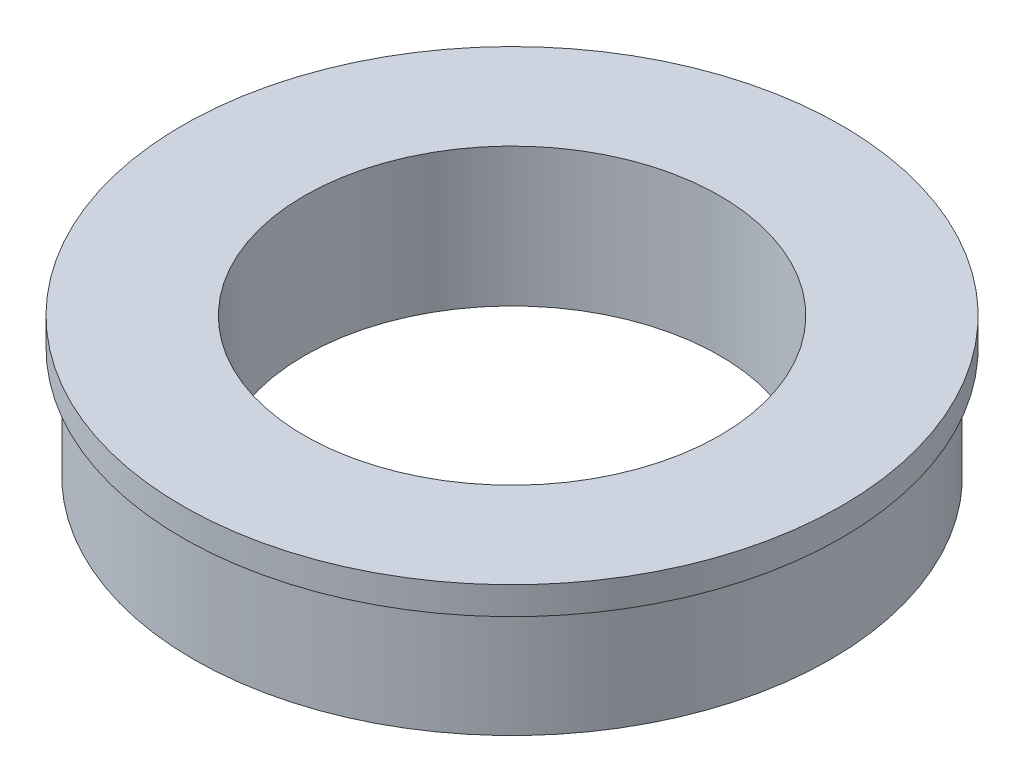
ISO-10303-21;
HEADER;
FILE_DESCRIPTION(('STEP AP214'),'2;1');
FILE_NAME('part.step','',(''),(''),'','','');
FILE_SCHEMA(('AUTOMOTIVE_DESIGN { 1 0 10303 214 1 1 1 1 }'));
ENDSEC;
DATA;
#1=APPLICATION_CONTEXT('core data for automotive mechanical design processes');
#2=APPLICATION_PROTOCOL_DEFINITION('international standard','automotive_design',2000,#1);
#3=PRODUCT_CONTEXT('',#1,'mechanical');
#4=PRODUCT('Part','Part','',(#3));
#5=PRODUCT_RELATED_PRODUCT_CATEGORY('part','',(#4));
#6=PRODUCT_DEFINITION_FORMATION('','',#4);
#7=PRODUCT_DEFINITION_CONTEXT('part definition',#1,'design');
#8=PRODUCT_DEFINITION('design','',#6,#7);
#9=PRODUCT_DEFINITION_SHAPE('','',#8);
#10=(LENGTH_UNIT() NAMED_UNIT(*) SI_UNIT(.MILLI.,.METRE.));
#11=(NAMED_UNIT(*) PLANE_ANGLE_UNIT() SI_UNIT($,.RADIAN.));
#12=(NAMED_UNIT(*) SI_UNIT($,.STERADIAN.) SOLID_ANGLE_UNIT());
#13=UNCERTAINTY_MEASURE_WITH_UNIT(LENGTH_MEASURE(1.E-05),#10,'distance_accuracy_value','');
#14=(GEOMETRIC_REPRESENTATION_CONTEXT(3) GLOBAL_UNCERTAINTY_ASSIGNED_CONTEXT((#13)) GLOBAL_UNIT_ASSIGNED_CONTEXT((#10,
#11,#12)) REPRESENTATION_CONTEXT('',''));
#15=CARTESIAN_POINT('',(0.,0.,0.));
#16=DIRECTION('',(0.,0.,1.));
#17=DIRECTION('',(1.,0.,0.));
#18=AXIS2_PLACEMENT_3D('',#15,#16,#17);
#19=CARTESIAN_POINT('',(7.5565,9.9553463855421,0.));
#20=DIRECTION('',(0.,1.,0.));
#21=DIRECTION('',(-1.,0.,0.));
#22=AXIS2_PLACEMENT_3D('',#19,#20,#21);
#23=PLANE('',#22);
#24=CARTESIAN_POINT('',(0.,9.95534638554208,0.));
#25=DIRECTION('',(0.,-1.,0.));
#26=DIRECTION('',(1.,0.,0.));
#27=AXIS2_PLACEMENT_3D('',#24,#25,#26);
#28=CIRCLE('',#27,4.7625);
#29=CARTESIAN_POINT('',(4.76249999999996,9.9553463855421,0.));
#30=VERTEX_POINT('',#29);
#31=EDGE_CURVE('E10',#30,#30,#28,.T.);
#32=ORIENTED_EDGE('',*,*,#31,.T.);
#33=EDGE_LOOP('',(#32));
#34=FACE_BOUND('',#33,.T.);
#35=CARTESIAN_POINT('',(0.,9.95534638554207,0.));
#36=DIRECTION('',(0.,-1.,0.));
#37=DIRECTION('',(1.,0.,0.));
#38=AXIS2_PLACEMENT_3D('',#35,#36,#37);
#39=CIRCLE('',#38,7.55650000000004);
#40=CARTESIAN_POINT('',(7.5565,9.9553463855421,0.));
#41=VERTEX_POINT('',#40);
#42=EDGE_CURVE('E53',#41,#41,#39,.T.);
#43=ORIENTED_EDGE('',*,*,#42,.F.);
#44=EDGE_LOOP('',(#43));
#45=FACE_BOUND('',#44,.T.);
#46=ADVANCED_FACE('F31',(#34,#45),#23,.T.);
#47=CARTESIAN_POINT('',(0.,-19.4229668674697,0.));
#48=DIRECTION('',(0.,-1.,0.));
#49=DIRECTION('',(1.,0.,0.));
#50=AXIS2_PLACEMENT_3D('',#47,#48,#49);
#51=CYLINDRICAL_SURFACE('',#50,4.76250000000001);
#52=CARTESIAN_POINT('',(0.,6.78034638554208,0.));
#53=DIRECTION('',(0.,-1.,0.));
#54=DIRECTION('',(1.,0.,0.));
#55=AXIS2_PLACEMENT_3D('',#52,#53,#54);
#56=CIRCLE('',#55,4.76250000000002);
#57=CARTESIAN_POINT('',(4.7625,6.7803463855421,0.));
#58=VERTEX_POINT('',#57);
#59=EDGE_CURVE('E37',#58,#58,#56,.T.);
#60=ORIENTED_EDGE('',*,*,#59,.T.);
#61=EDGE_LOOP('',(#60));
#62=FACE_BOUND('',#61,.T.);
#63=ORIENTED_EDGE('',*,*,#31,.F.);
#64=EDGE_LOOP('',(#63));
#65=FACE_BOUND('',#64,.T.);
#66=ADVANCED_FACE('F61',(#62,#65),#51,.F.);
#67=CARTESIAN_POINT('',(4.7625,6.78034638554209,0.));
#68=DIRECTION('',(0.,-1.,0.));
#69=DIRECTION('',(1.,0.,0.));
#70=AXIS2_PLACEMENT_3D('',#67,#68,#69);
#71=PLANE('',#70);
#72=CARTESIAN_POINT('',(0.,6.78034638554207,0.));
#73=DIRECTION('',(0.,-1.,0.));
#74=DIRECTION('',(1.,0.,0.));
#75=AXIS2_PLACEMENT_3D('',#72,#73,#74);
#76=CIRCLE('',#75,7.30249999999999);
#77=CARTESIAN_POINT('',(7.30249999999997,6.7803463855421,0.));
#78=VERTEX_POINT('',#77);
#79=EDGE_CURVE('E41',#78,#78,#76,.T.);
#80=ORIENTED_EDGE('',*,*,#79,.T.);
#81=EDGE_LOOP('',(#80));
#82=FACE_BOUND('',#81,.T.);
#83=ORIENTED_EDGE('',*,*,#59,.F.);
#84=EDGE_LOOP('',(#83));
#85=FACE_BOUND('',#84,.T.);
#86=ADVANCED_FACE('F65',(#82,#85),#71,.T.);
#87=CARTESIAN_POINT('',(0.,-19.4229668674697,0.));
#88=DIRECTION('',(0.,-1.,0.));
#89=DIRECTION('',(1.,0.,0.));
#90=AXIS2_PLACEMENT_3D('',#87,#88,#89);
#91=CYLINDRICAL_SURFACE('',#90,7.30249999999999);
#92=CARTESIAN_POINT('',(0.,9.32034638554207,0.));
#93=DIRECTION('',(0.,-1.,0.));
#94=DIRECTION('',(1.,0.,0.));
#95=AXIS2_PLACEMENT_3D('',#92,#93,#94);
#96=CIRCLE('',#95,7.3025);
#97=CARTESIAN_POINT('',(7.30249999999996,9.3203463855421,0.));
#98=VERTEX_POINT('',#97);
#99=EDGE_CURVE('E45',#98,#98,#96,.T.);
#100=ORIENTED_EDGE('',*,*,#99,.T.);
#101=EDGE_LOOP('',(#100));
#102=FACE_BOUND('',#101,.T.);
#103=ORIENTED_EDGE('',*,*,#79,.F.);
#104=EDGE_LOOP('',(#103));
#105=FACE_BOUND('',#104,.T.);
#106=ADVANCED_FACE('F69',(#102,#105),#91,.T.);
#107=CARTESIAN_POINT('',(7.30249999999996,9.3203463855421,0.));
#108=DIRECTION('',(0.,-1.,0.));
#109=DIRECTION('',(1.,0.,0.));
#110=AXIS2_PLACEMENT_3D('',#107,#108,#109);
#111=PLANE('',#110);
#112=CARTESIAN_POINT('',(0.,9.32034638554207,0.));
#113=DIRECTION('',(0.,-1.,0.));
#114=DIRECTION('',(1.,0.,0.));
#115=AXIS2_PLACEMENT_3D('',#112,#113,#114);
#116=CIRCLE('',#115,7.55650000000003);
#117=CARTESIAN_POINT('',(7.5565,9.3203463855421,0.));
#118=VERTEX_POINT('',#117);
#119=EDGE_CURVE('E50',#118,#118,#116,.T.);
#120=ORIENTED_EDGE('',*,*,#119,.T.);
#121=EDGE_LOOP('',(#120));
#122=FACE_BOUND('',#121,.T.);
#123=ORIENTED_EDGE('',*,*,#99,.F.);
#124=EDGE_LOOP('',(#123));
#125=FACE_BOUND('',#124,.T.);
#126=ADVANCED_FACE('F76',(#122,#125),#111,.T.);
#127=CARTESIAN_POINT('',(0.,-19.4229668674697,0.));
#128=DIRECTION('',(0.,-1.,0.));
#129=DIRECTION('',(1.,0.,0.));
#130=AXIS2_PLACEMENT_3D('',#127,#128,#129);
#131=CYLINDRICAL_SURFACE('',#130,7.55650000000003);
#132=ORIENTED_EDGE('',*,*,#42,.T.);
#133=EDGE_LOOP('',(#132));
#134=FACE_BOUND('',#133,.T.);
#135=ORIENTED_EDGE('',*,*,#119,.F.);
#136=EDGE_LOOP('',(#135));
#137=FACE_BOUND('',#136,.T.);
#138=ADVANCED_FACE('F57',(#134,#137),#131,.T.);
#139=CLOSED_SHELL('',(#46,#66,#86,#106,#126,#138));
#140=MANIFOLD_SOLID_BREP('B2',#139);
#141=ADVANCED_BREP_SHAPE_REPRESENTATION('',(#18,#140),#14);
#142=SHAPE_DEFINITION_REPRESENTATION(#9,#141);
ENDSEC;
END-ISO-10303-21;
